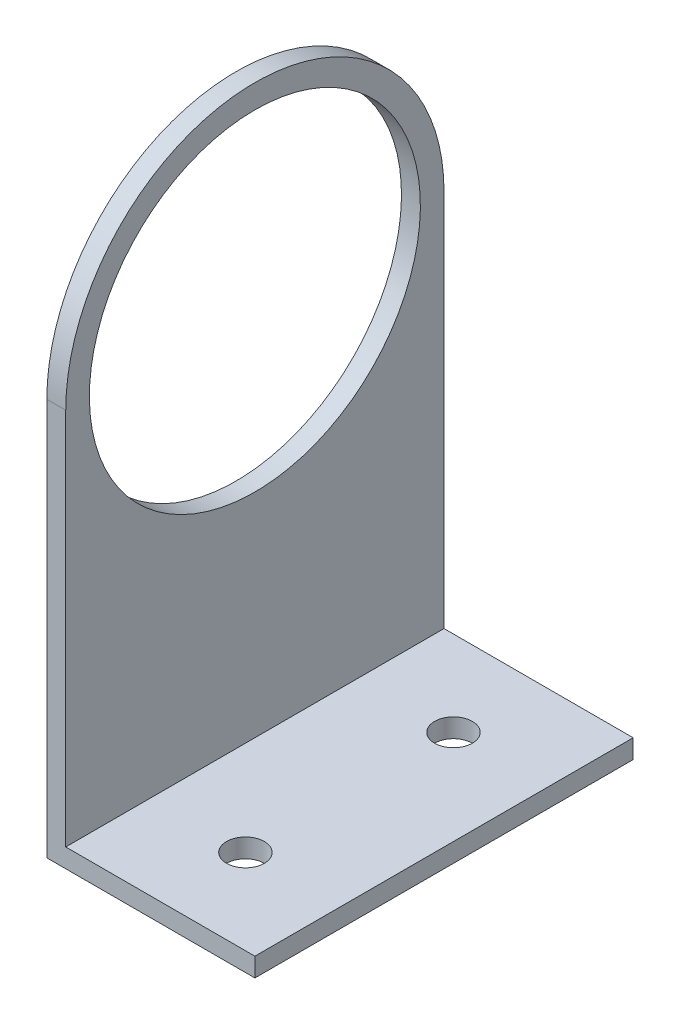
ISO-10303-21;
HEADER;
FILE_DESCRIPTION(('STEP AP214'),'2;1');
FILE_NAME('part.step','',(''),(''),'','','');
FILE_SCHEMA(('AUTOMOTIVE_DESIGN { 1 0 10303 214 1 1 1 1 }'));
ENDSEC;
DATA;
#1=APPLICATION_CONTEXT('core data for automotive mechanical design processes');
#2=APPLICATION_PROTOCOL_DEFINITION('international standard','automotive_design',2000,#1);
#3=PRODUCT_CONTEXT('',#1,'mechanical');
#4=PRODUCT('Part','Part','',(#3));
#5=PRODUCT_RELATED_PRODUCT_CATEGORY('part','',(#4));
#6=PRODUCT_DEFINITION_FORMATION('','',#4);
#7=PRODUCT_DEFINITION_CONTEXT('part definition',#1,'design');
#8=PRODUCT_DEFINITION('design','',#6,#7);
#9=PRODUCT_DEFINITION_SHAPE('','',#8);
#10=(LENGTH_UNIT() NAMED_UNIT(*) SI_UNIT(.MILLI.,.METRE.));
#11=(NAMED_UNIT(*) PLANE_ANGLE_UNIT() SI_UNIT($,.RADIAN.));
#12=(NAMED_UNIT(*) SI_UNIT($,.STERADIAN.) SOLID_ANGLE_UNIT());
#13=UNCERTAINTY_MEASURE_WITH_UNIT(LENGTH_MEASURE(1.E-05),#10,'distance_accuracy_value','');
#14=(GEOMETRIC_REPRESENTATION_CONTEXT(3) GLOBAL_UNCERTAINTY_ASSIGNED_CONTEXT((#13)) GLOBAL_UNIT_ASSIGNED_CONTEXT((#10,
#11,#12)) REPRESENTATION_CONTEXT('',''));
#15=CARTESIAN_POINT('',(0.,0.,0.));
#16=DIRECTION('',(0.,0.,1.));
#17=DIRECTION('',(1.,0.,0.));
#18=AXIS2_PLACEMENT_3D('',#15,#16,#17);
#19=CARTESIAN_POINT('',(1.99999999999998,62.,40.));
#20=DIRECTION('',(-1.,0.,0.));
#21=DIRECTION('',(0.,-1.,0.));
#22=AXIS2_PLACEMENT_3D('',#19,#20,#21);
#23=PLANE('',#22);
#24=CARTESIAN_POINT('',(1.99999999999999,42.,20.));
#25=DIRECTION('',(1.,0.,0.));
#26=DIRECTION('',(0.,1.,0.));
#27=AXIS2_PLACEMENT_3D('',#24,#25,#26);
#28=CIRCLE('',#27,17.5);
#29=CARTESIAN_POINT('',(1.99999999999999,59.5,20.));
#30=VERTEX_POINT('',#29);
#31=EDGE_CURVE('E140',#30,#30,#28,.T.);
#32=ORIENTED_EDGE('',*,*,#31,.F.);
#33=EDGE_LOOP('',(#32));
#34=FACE_BOUND('',#33,.T.);
#35=DIRECTION('',(0.,1.,0.));
#36=VECTOR('',#35,1.);
#37=CARTESIAN_POINT('',(1.99999999999998,62.,0.));
#38=LINE('',#37,#36);
#39=CARTESIAN_POINT('',(2.,2.,0.));
#40=VERTEX_POINT('',#39);
#41=CARTESIAN_POINT('',(1.99999999999999,42.,0.));
#42=VERTEX_POINT('',#41);
#43=EDGE_CURVE('E109',#40,#42,#38,.T.);
#44=ORIENTED_EDGE('',*,*,#43,.T.);
#45=CARTESIAN_POINT('',(1.99999999999999,42.,20.));
#46=DIRECTION('',(1.,0.,0.));
#47=DIRECTION('',(0.,1.,0.));
#48=AXIS2_PLACEMENT_3D('',#45,#46,#47);
#49=CIRCLE('',#48,20.);
#50=CARTESIAN_POINT('',(1.99999999999999,42.,40.));
#51=VERTEX_POINT('',#50);
#52=EDGE_CURVE('E93',#42,#51,#49,.T.);
#53=ORIENTED_EDGE('',*,*,#52,.T.);
#54=DIRECTION('',(0.,1.,0.));
#55=VECTOR('',#54,1.);
#56=CARTESIAN_POINT('',(1.99999999999998,62.,40.));
#57=LINE('',#56,#55);
#58=CARTESIAN_POINT('',(2.,2.,40.));
#59=VERTEX_POINT('',#58);
#60=EDGE_CURVE('E133',#59,#51,#57,.T.);
#61=ORIENTED_EDGE('',*,*,#60,.F.);
#62=DIRECTION('',(0.,0.,-1.));
#63=VECTOR('',#62,1.);
#64=CARTESIAN_POINT('',(2.,2.,40.));
#65=LINE('',#64,#63);
#66=EDGE_CURVE('E118',#59,#40,#65,.T.);
#67=ORIENTED_EDGE('',*,*,#66,.T.);
#68=EDGE_LOOP('',(#44,#53,#61,#67));
#69=FACE_BOUND('',#68,.T.);
#70=ADVANCED_FACE('F34',(#34,#69),#23,.F.);
#71=CARTESIAN_POINT('',(0.,0.,40.));
#72=DIRECTION('',(1.,0.,0.));
#73=DIRECTION('',(0.,1.,0.));
#74=AXIS2_PLACEMENT_3D('',#71,#72,#73);
#75=PLANE('',#74);
#76=CARTESIAN_POINT('',(0.,42.,20.));
#77=DIRECTION('',(1.,0.,0.));
#78=DIRECTION('',(0.,1.,0.));
#79=AXIS2_PLACEMENT_3D('',#76,#77,#78);
#80=CIRCLE('',#79,17.5);
#81=CARTESIAN_POINT('',(0.,59.5,20.));
#82=VERTEX_POINT('',#81);
#83=EDGE_CURVE('E131',#82,#82,#80,.F.);
#84=ORIENTED_EDGE('',*,*,#83,.F.);
#85=EDGE_LOOP('',(#84));
#86=FACE_BOUND('',#85,.T.);
#87=CARTESIAN_POINT('',(0.,42.,20.));
#88=DIRECTION('',(1.,0.,0.));
#89=DIRECTION('',(0.,1.,0.));
#90=AXIS2_PLACEMENT_3D('',#87,#88,#89);
#91=CIRCLE('',#90,20.);
#92=CARTESIAN_POINT('',(0.,42.,40.));
#93=VERTEX_POINT('',#92);
#94=CARTESIAN_POINT('',(0.,42.,0.));
#95=VERTEX_POINT('',#94);
#96=EDGE_CURVE('E49',#93,#95,#91,.F.);
#97=ORIENTED_EDGE('',*,*,#96,.T.);
#98=DIRECTION('',(0.,-1.,0.));
#99=VECTOR('',#98,1.);
#100=CARTESIAN_POINT('',(0.,0.,0.));
#101=LINE('',#100,#99);
#102=CARTESIAN_POINT('',(0.,0.,0.));
#103=VERTEX_POINT('',#102);
#104=EDGE_CURVE('E78',#95,#103,#101,.T.);
#105=ORIENTED_EDGE('',*,*,#104,.T.);
#106=DIRECTION('',(0.,0.,-1.));
#107=VECTOR('',#106,1.);
#108=CARTESIAN_POINT('',(0.,0.,40.));
#109=LINE('',#108,#107);
#110=CARTESIAN_POINT('',(0.,0.,40.));
#111=VERTEX_POINT('',#110);
#112=EDGE_CURVE('E116',#111,#103,#109,.T.);
#113=ORIENTED_EDGE('',*,*,#112,.F.);
#114=DIRECTION('',(0.,-1.,0.));
#115=VECTOR('',#114,1.);
#116=CARTESIAN_POINT('',(0.,0.,40.));
#117=LINE('',#116,#115);
#118=EDGE_CURVE('E57',#93,#111,#117,.T.);
#119=ORIENTED_EDGE('',*,*,#118,.F.);
#120=EDGE_LOOP('',(#97,#105,#113,#119));
#121=FACE_BOUND('',#120,.T.);
#122=ADVANCED_FACE('F92',(#86,#121),#75,.F.);
#123=CARTESIAN_POINT('',(0.,0.,0.));
#124=DIRECTION('',(0.,0.,-1.));
#125=DIRECTION('',(-1.,0.,0.));
#126=AXIS2_PLACEMENT_3D('',#123,#124,#125);
#127=PLANE('',#126);
#128=ORIENTED_EDGE('',*,*,#104,.F.);
#129=DIRECTION('',(1.,0.,0.));
#130=VECTOR('',#129,1.);
#131=CARTESIAN_POINT('',(-0.00100000000002615,42.,0.));
#132=LINE('',#131,#130);
#133=EDGE_CURVE('E94',#95,#42,#132,.T.);
#134=ORIENTED_EDGE('',*,*,#133,.T.);
#135=ORIENTED_EDGE('',*,*,#43,.F.);
#136=DIRECTION('',(-1.,0.,0.));
#137=VECTOR('',#136,1.);
#138=CARTESIAN_POINT('',(2.,2.,0.));
#139=LINE('',#138,#137);
#140=CARTESIAN_POINT('',(22.,2.,0.));
#141=VERTEX_POINT('',#140);
#142=EDGE_CURVE('E112',#141,#40,#139,.T.);
#143=ORIENTED_EDGE('',*,*,#142,.F.);
#144=DIRECTION('',(0.,1.,0.));
#145=VECTOR('',#144,1.);
#146=CARTESIAN_POINT('',(22.,2.,0.));
#147=LINE('',#146,#145);
#148=CARTESIAN_POINT('',(22.,0.,0.));
#149=VERTEX_POINT('',#148);
#150=EDGE_CURVE('E127',#149,#141,#147,.T.);
#151=ORIENTED_EDGE('',*,*,#150,.F.);
#152=DIRECTION('',(1.,0.,0.));
#153=VECTOR('',#152,1.);
#154=CARTESIAN_POINT('',(22.,0.,0.));
#155=LINE('',#154,#153);
#156=EDGE_CURVE('E107',#103,#149,#155,.T.);
#157=ORIENTED_EDGE('',*,*,#156,.F.);
#158=EDGE_LOOP('',(#128,#134,#135,#143,#151,#157));
#159=FACE_BOUND('',#158,.T.);
#160=ADVANCED_FACE('F105',(#159),#127,.T.);
#161=CARTESIAN_POINT('',(0.,0.,40.));
#162=DIRECTION('',(0.,0.,-1.));
#163=DIRECTION('',(-1.,0.,0.));
#164=AXIS2_PLACEMENT_3D('',#161,#162,#163);
#165=PLANE('',#164);
#166=DIRECTION('',(1.,0.,0.));
#167=VECTOR('',#166,1.);
#168=CARTESIAN_POINT('',(-0.00100000000002615,42.,40.));
#169=LINE('',#168,#167);
#170=EDGE_CURVE('E143',#93,#51,#169,.T.);
#171=ORIENTED_EDGE('',*,*,#170,.F.);
#172=ORIENTED_EDGE('',*,*,#118,.T.);
#173=DIRECTION('',(1.,0.,0.));
#174=VECTOR('',#173,1.);
#175=CARTESIAN_POINT('',(22.,0.,40.));
#176=LINE('',#175,#174);
#177=CARTESIAN_POINT('',(22.,0.,40.));
#178=VERTEX_POINT('',#177);
#179=EDGE_CURVE('E108',#111,#178,#176,.T.);
#180=ORIENTED_EDGE('',*,*,#179,.T.);
#181=DIRECTION('',(0.,1.,0.));
#182=VECTOR('',#181,1.);
#183=CARTESIAN_POINT('',(22.,2.,40.));
#184=LINE('',#183,#182);
#185=CARTESIAN_POINT('',(22.,2.,40.));
#186=VERTEX_POINT('',#185);
#187=EDGE_CURVE('E85',#178,#186,#184,.T.);
#188=ORIENTED_EDGE('',*,*,#187,.T.);
#189=DIRECTION('',(-1.,0.,0.));
#190=VECTOR('',#189,1.);
#191=CARTESIAN_POINT('',(2.,2.,40.));
#192=LINE('',#191,#190);
#193=EDGE_CURVE('E126',#186,#59,#192,.T.);
#194=ORIENTED_EDGE('',*,*,#193,.T.);
#195=ORIENTED_EDGE('',*,*,#60,.T.);
#196=EDGE_LOOP('',(#171,#172,#180,#188,#194,#195));
#197=FACE_BOUND('',#196,.T.);
#198=ADVANCED_FACE('F176',(#197),#165,.F.);
#199=CARTESIAN_POINT('',(22.,0.,40.));
#200=DIRECTION('',(0.,1.,0.));
#201=DIRECTION('',(-1.,0.,0.));
#202=AXIS2_PLACEMENT_3D('',#199,#200,#201);
#203=PLANE('',#202);
#204=CARTESIAN_POINT('',(12.,0.,9.00000000000001));
#205=DIRECTION('',(0.,1.,0.));
#206=DIRECTION('',(-1.,0.,0.));
#207=AXIS2_PLACEMENT_3D('',#204,#205,#206);
#208=CIRCLE('',#207,2.);
#209=CARTESIAN_POINT('',(10.,0.,9.00000000000001));
#210=VERTEX_POINT('',#209);
#211=EDGE_CURVE('E102',#210,#210,#208,.F.);
#212=ORIENTED_EDGE('',*,*,#211,.F.);
#213=EDGE_LOOP('',(#212));
#214=FACE_BOUND('',#213,.T.);
#215=CARTESIAN_POINT('',(12.,0.,31.));
#216=DIRECTION('',(0.,1.,0.));
#217=DIRECTION('',(-1.,0.,0.));
#218=AXIS2_PLACEMENT_3D('',#215,#216,#217);
#219=CIRCLE('',#218,2.);
#220=CARTESIAN_POINT('',(10.,0.,31.));
#221=VERTEX_POINT('',#220);
#222=EDGE_CURVE('E146',#221,#221,#219,.F.);
#223=ORIENTED_EDGE('',*,*,#222,.F.);
#224=EDGE_LOOP('',(#223));
#225=FACE_BOUND('',#224,.T.);
#226=ORIENTED_EDGE('',*,*,#156,.T.);
#227=DIRECTION('',(0.,0.,-1.));
#228=VECTOR('',#227,1.);
#229=CARTESIAN_POINT('',(22.,0.,40.));
#230=LINE('',#229,#228);
#231=EDGE_CURVE('E11',#178,#149,#230,.T.);
#232=ORIENTED_EDGE('',*,*,#231,.F.);
#233=ORIENTED_EDGE('',*,*,#179,.F.);
#234=ORIENTED_EDGE('',*,*,#112,.T.);
#235=EDGE_LOOP('',(#226,#232,#233,#234));
#236=FACE_BOUND('',#235,.T.);
#237=ADVANCED_FACE('F36',(#214,#225,#236),#203,.F.);
#238=CARTESIAN_POINT('',(22.,2.,40.));
#239=DIRECTION('',(-1.,0.,0.));
#240=DIRECTION('',(0.,0.,1.));
#241=AXIS2_PLACEMENT_3D('',#238,#239,#240);
#242=PLANE('',#241);
#243=ORIENTED_EDGE('',*,*,#150,.T.);
#244=DIRECTION('',(0.,0.,-1.));
#245=VECTOR('',#244,1.);
#246=CARTESIAN_POINT('',(22.,2.,40.));
#247=LINE('',#246,#245);
#248=EDGE_CURVE('E42',#186,#141,#247,.T.);
#249=ORIENTED_EDGE('',*,*,#248,.F.);
#250=ORIENTED_EDGE('',*,*,#187,.F.);
#251=ORIENTED_EDGE('',*,*,#231,.T.);
#252=EDGE_LOOP('',(#243,#249,#250,#251));
#253=FACE_BOUND('',#252,.T.);
#254=ADVANCED_FACE('F164',(#253),#242,.F.);
#255=CARTESIAN_POINT('',(2.,2.,40.));
#256=DIRECTION('',(0.,-1.,0.));
#257=DIRECTION('',(1.,0.,0.));
#258=AXIS2_PLACEMENT_3D('',#255,#256,#257);
#259=PLANE('',#258);
#260=CARTESIAN_POINT('',(12.,2.,9.00000000000001));
#261=DIRECTION('',(0.,1.,0.));
#262=DIRECTION('',(-1.,0.,0.));
#263=AXIS2_PLACEMENT_3D('',#260,#261,#262);
#264=CIRCLE('',#263,2.);
#265=CARTESIAN_POINT('',(10.,2.,9.00000000000001));
#266=VERTEX_POINT('',#265);
#267=EDGE_CURVE('E149',#266,#266,#264,.T.);
#268=ORIENTED_EDGE('',*,*,#267,.F.);
#269=EDGE_LOOP('',(#268));
#270=FACE_BOUND('',#269,.T.);
#271=CARTESIAN_POINT('',(12.,2.,31.));
#272=DIRECTION('',(0.,1.,0.));
#273=DIRECTION('',(-1.,0.,0.));
#274=AXIS2_PLACEMENT_3D('',#271,#272,#273);
#275=CIRCLE('',#274,2.);
#276=CARTESIAN_POINT('',(10.,2.,31.));
#277=VERTEX_POINT('',#276);
#278=EDGE_CURVE('E150',#277,#277,#275,.T.);
#279=ORIENTED_EDGE('',*,*,#278,.F.);
#280=EDGE_LOOP('',(#279));
#281=FACE_BOUND('',#280,.T.);
#282=ORIENTED_EDGE('',*,*,#142,.T.);
#283=ORIENTED_EDGE('',*,*,#66,.F.);
#284=ORIENTED_EDGE('',*,*,#193,.F.);
#285=ORIENTED_EDGE('',*,*,#248,.T.);
#286=EDGE_LOOP('',(#282,#283,#284,#285));
#287=FACE_BOUND('',#286,.T.);
#288=ADVANCED_FACE('F124',(#270,#281,#287),#259,.F.);
#289=CARTESIAN_POINT('',(-0.00100000000002615,42.,20.));
#290=DIRECTION('',(1.,0.,0.));
#291=DIRECTION('',(0.,1.,0.));
#292=AXIS2_PLACEMENT_3D('',#289,#290,#291);
#293=CYLINDRICAL_SURFACE('',#292,17.5);
#294=ORIENTED_EDGE('',*,*,#31,.T.);
#295=EDGE_LOOP('',(#294));
#296=FACE_BOUND('',#295,.T.);
#297=ORIENTED_EDGE('',*,*,#83,.T.);
#298=EDGE_LOOP('',(#297));
#299=FACE_BOUND('',#298,.T.);
#300=ADVANCED_FACE('F163',(#296,#299),#293,.F.);
#301=CARTESIAN_POINT('',(-0.00100000000002615,42.,20.));
#302=DIRECTION('',(1.,0.,0.));
#303=DIRECTION('',(0.,1.,0.));
#304=AXIS2_PLACEMENT_3D('',#301,#302,#303);
#305=CYLINDRICAL_SURFACE('',#304,20.);
#306=ORIENTED_EDGE('',*,*,#170,.T.);
#307=ORIENTED_EDGE('',*,*,#52,.F.);
#308=ORIENTED_EDGE('',*,*,#133,.F.);
#309=ORIENTED_EDGE('',*,*,#96,.F.);
#310=EDGE_LOOP('',(#306,#307,#308,#309));
#311=FACE_BOUND('',#310,.T.);
#312=ADVANCED_FACE('F97',(#311),#305,.T.);
#313=CARTESIAN_POINT('',(12.,-0.001000000000001,31.));
#314=DIRECTION('',(0.,1.,0.));
#315=DIRECTION('',(-1.,0.,0.));
#316=AXIS2_PLACEMENT_3D('',#313,#314,#315);
#317=CYLINDRICAL_SURFACE('',#316,2.);
#318=ORIENTED_EDGE('',*,*,#278,.T.);
#319=EDGE_LOOP('',(#318));
#320=FACE_BOUND('',#319,.T.);
#321=ORIENTED_EDGE('',*,*,#222,.T.);
#322=EDGE_LOOP('',(#321));
#323=FACE_BOUND('',#322,.T.);
#324=ADVANCED_FACE('F168',(#320,#323),#317,.F.);
#325=CARTESIAN_POINT('',(12.,-0.001000000000001,9.00000000000001));
#326=DIRECTION('',(0.,1.,0.));
#327=DIRECTION('',(-1.,0.,0.));
#328=AXIS2_PLACEMENT_3D('',#325,#326,#327);
#329=CYLINDRICAL_SURFACE('',#328,2.);
#330=ORIENTED_EDGE('',*,*,#267,.T.);
#331=EDGE_LOOP('',(#330));
#332=FACE_BOUND('',#331,.T.);
#333=ORIENTED_EDGE('',*,*,#211,.T.);
#334=EDGE_LOOP('',(#333));
#335=FACE_BOUND('',#334,.T.);
#336=ADVANCED_FACE('F158',(#332,#335),#329,.F.);
#337=CLOSED_SHELL('',(#70,#122,#160,#198,#237,#254,#288,#300,#312,#324,#336));
#338=MANIFOLD_SOLID_BREP('B2',#337);
#339=ADVANCED_BREP_SHAPE_REPRESENTATION('',(#18,#338),#14);
#340=SHAPE_DEFINITION_REPRESENTATION(#9,#339);
ENDSEC;
END-ISO-10303-21;
